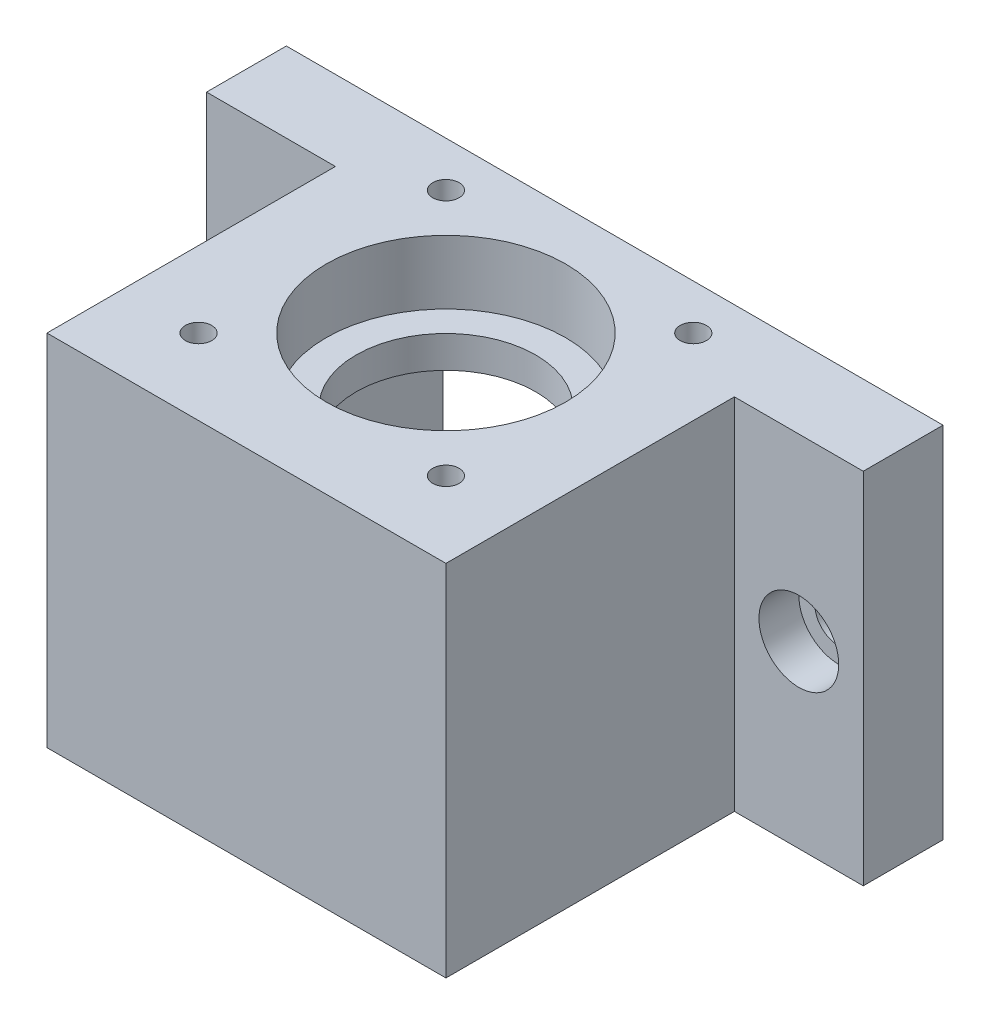
ISO-10303-21;
HEADER;
FILE_DESCRIPTION(('STEP AP214'),'2;1');
FILE_NAME('part.step','',(''),(''),'','','');
FILE_SCHEMA(('AUTOMOTIVE_DESIGN { 1 0 10303 214 1 1 1 1 }'));
ENDSEC;
DATA;
#1=APPLICATION_CONTEXT('core data for automotive mechanical design processes');
#2=APPLICATION_PROTOCOL_DEFINITION('international standard','automotive_design',2000,#1);
#3=PRODUCT_CONTEXT('',#1,'mechanical');
#4=PRODUCT('Part','Part','',(#3));
#5=PRODUCT_RELATED_PRODUCT_CATEGORY('part','',(#4));
#6=PRODUCT_DEFINITION_FORMATION('','',#4);
#7=PRODUCT_DEFINITION_CONTEXT('part definition',#1,'design');
#8=PRODUCT_DEFINITION('design','',#6,#7);
#9=PRODUCT_DEFINITION_SHAPE('','',#8);
#10=(LENGTH_UNIT() NAMED_UNIT(*) SI_UNIT(.MILLI.,.METRE.));
#11=(NAMED_UNIT(*) PLANE_ANGLE_UNIT() SI_UNIT($,.RADIAN.));
#12=(NAMED_UNIT(*) SI_UNIT($,.STERADIAN.) SOLID_ANGLE_UNIT());
#13=UNCERTAINTY_MEASURE_WITH_UNIT(LENGTH_MEASURE(1.E-05),#10,'distance_accuracy_value','');
#14=(GEOMETRIC_REPRESENTATION_CONTEXT(3) GLOBAL_UNCERTAINTY_ASSIGNED_CONTEXT((#13)) GLOBAL_UNIT_ASSIGNED_CONTEXT((#10,
#11,#12)) REPRESENTATION_CONTEXT('',''));
#15=CARTESIAN_POINT('',(0.,0.,0.));
#16=DIRECTION('',(0.,0.,1.));
#17=DIRECTION('',(1.,0.,0.));
#18=AXIS2_PLACEMENT_3D('',#15,#16,#17);
#19=CARTESIAN_POINT('',(0.,45.,0.));
#20=DIRECTION('',(0.,-1.,0.));
#21=DIRECTION('',(0.,0.,-1.));
#22=AXIS2_PLACEMENT_3D('',#19,#20,#21);
#23=CYLINDRICAL_SURFACE('',#22,11.25);
#24=CARTESIAN_POINT('',(0.,33.,0.));
#25=DIRECTION('',(0.,-1.,0.));
#26=DIRECTION('',(0.,0.,-1.));
#27=AXIS2_PLACEMENT_3D('',#24,#25,#26);
#28=CIRCLE('',#27,11.25);
#29=CARTESIAN_POINT('',(0.,33.,-11.25));
#30=VERTEX_POINT('',#29);
#31=EDGE_CURVE('E229',#30,#30,#28,.T.);
#32=ORIENTED_EDGE('',*,*,#31,.T.);
#33=EDGE_LOOP('',(#32));
#34=FACE_BOUND('',#33,.T.);
#35=CARTESIAN_POINT('',(0.,37.,0.));
#36=DIRECTION('',(0.,1.,0.));
#37=DIRECTION('',(0.,0.,1.));
#38=AXIS2_PLACEMENT_3D('',#35,#36,#37);
#39=CIRCLE('',#38,11.25);
#40=CARTESIAN_POINT('',(0.,37.,11.25));
#41=VERTEX_POINT('',#40);
#42=EDGE_CURVE('E39',#41,#41,#39,.F.);
#43=ORIENTED_EDGE('',*,*,#42,.F.);
#44=EDGE_LOOP('',(#43));
#45=FACE_BOUND('',#44,.T.);
#46=ADVANCED_FACE('F35',(#34,#45),#23,.F.);
#47=CARTESIAN_POINT('',(33.075,22.5,-21.15));
#48=DIRECTION('',(0.,0.,1.));
#49=DIRECTION('',(1.,0.,0.));
#50=AXIS2_PLACEMENT_3D('',#47,#48,#49);
#51=CYLINDRICAL_SURFACE('',#50,3.);
#52=CARTESIAN_POINT('',(33.075,22.5,-21.15));
#53=DIRECTION('',(0.,0.,1.));
#54=DIRECTION('',(1.,0.,0.));
#55=AXIS2_PLACEMENT_3D('',#52,#53,#54);
#56=CIRCLE('',#55,3.);
#57=CARTESIAN_POINT('',(36.075,22.5,-21.15));
#58=VERTEX_POINT('',#57);
#59=EDGE_CURVE('E179',#58,#58,#56,.T.);
#60=ORIENTED_EDGE('',*,*,#59,.F.);
#61=EDGE_LOOP('',(#60));
#62=FACE_BOUND('',#61,.T.);
#63=CARTESIAN_POINT('',(33.075,22.5,-16.15));
#64=DIRECTION('',(0.,0.,1.));
#65=DIRECTION('',(1.,0.,0.));
#66=AXIS2_PLACEMENT_3D('',#63,#64,#65);
#67=CIRCLE('',#66,3.);
#68=CARTESIAN_POINT('',(36.075,22.5,-16.15));
#69=VERTEX_POINT('',#68);
#70=EDGE_CURVE('E181',#69,#69,#67,.F.);
#71=ORIENTED_EDGE('',*,*,#70,.F.);
#72=EDGE_LOOP('',(#71));
#73=FACE_BOUND('',#72,.T.);
#74=ADVANCED_FACE('F361',(#62,#73),#51,.F.);
#75=CARTESIAN_POINT('',(-33.075,22.5,-21.15));
#76=DIRECTION('',(0.,0.,1.));
#77=DIRECTION('',(1.,0.,0.));
#78=AXIS2_PLACEMENT_3D('',#75,#76,#77);
#79=CYLINDRICAL_SURFACE('',#78,3.);
#80=CARTESIAN_POINT('',(-33.075,22.5,-21.15));
#81=DIRECTION('',(0.,0.,1.));
#82=DIRECTION('',(1.,0.,0.));
#83=AXIS2_PLACEMENT_3D('',#80,#81,#82);
#84=CIRCLE('',#83,3.);
#85=CARTESIAN_POINT('',(-30.075,22.5,-21.15));
#86=VERTEX_POINT('',#85);
#87=EDGE_CURVE('E204',#86,#86,#84,.T.);
#88=ORIENTED_EDGE('',*,*,#87,.F.);
#89=EDGE_LOOP('',(#88));
#90=FACE_BOUND('',#89,.T.);
#91=CARTESIAN_POINT('',(-33.075,22.5,-16.15));
#92=DIRECTION('',(0.,0.,1.));
#93=DIRECTION('',(1.,0.,0.));
#94=AXIS2_PLACEMENT_3D('',#91,#92,#93);
#95=CIRCLE('',#94,3.);
#96=CARTESIAN_POINT('',(-30.075,22.5,-16.15));
#97=VERTEX_POINT('',#96);
#98=EDGE_CURVE('E177',#97,#97,#95,.F.);
#99=ORIENTED_EDGE('',*,*,#98,.F.);
#100=EDGE_LOOP('',(#99));
#101=FACE_BOUND('',#100,.T.);
#102=ADVANCED_FACE('F367',(#90,#101),#79,.F.);
#103=CARTESIAN_POINT('',(-21.15,45.,-21.15));
#104=DIRECTION('',(0.,0.,1.));
#105=DIRECTION('',(1.,0.,0.));
#106=AXIS2_PLACEMENT_3D('',#103,#104,#105);
#107=PLANE('',#106);
#108=ORIENTED_EDGE('',*,*,#59,.T.);
#109=EDGE_LOOP('',(#108));
#110=FACE_BOUND('',#109,.T.);
#111=ORIENTED_EDGE('',*,*,#87,.T.);
#112=EDGE_LOOP('',(#111));
#113=FACE_BOUND('',#112,.T.);
#114=DIRECTION('',(-1.,0.,0.));
#115=VECTOR('',#114,1.);
#116=CARTESIAN_POINT('',(-21.15,33.,-21.15));
#117=LINE('',#116,#115);
#118=CARTESIAN_POINT('',(21.5,33.,-21.15));
#119=VERTEX_POINT('',#118);
#120=CARTESIAN_POINT('',(-21.5,33.,-21.15));
#121=VERTEX_POINT('',#120);
#122=EDGE_CURVE('E11',#119,#121,#117,.T.);
#123=ORIENTED_EDGE('',*,*,#122,.T.);
#124=DIRECTION('',(0.,-1.,0.));
#125=VECTOR('',#124,1.);
#126=CARTESIAN_POINT('',(-21.5,45.,-21.15));
#127=LINE('',#126,#125);
#128=CARTESIAN_POINT('',(-21.5,0.,-21.15));
#129=VERTEX_POINT('',#128);
#130=EDGE_CURVE('E274',#121,#129,#127,.T.);
#131=ORIENTED_EDGE('',*,*,#130,.T.);
#132=DIRECTION('',(-1.,0.,0.));
#133=VECTOR('',#132,1.);
#134=CARTESIAN_POINT('',(-21.15,0.,-21.15));
#135=LINE('',#134,#133);
#136=CARTESIAN_POINT('',(-41.15,0.,-21.15));
#137=VERTEX_POINT('',#136);
#138=EDGE_CURVE('E147',#129,#137,#135,.T.);
#139=ORIENTED_EDGE('',*,*,#138,.T.);
#140=DIRECTION('',(0.,-1.,0.));
#141=VECTOR('',#140,1.);
#142=CARTESIAN_POINT('',(-41.15,45.,-21.15));
#143=LINE('',#142,#141);
#144=CARTESIAN_POINT('',(-41.15,45.,-21.15));
#145=VERTEX_POINT('',#144);
#146=EDGE_CURVE('E173',#145,#137,#143,.T.);
#147=ORIENTED_EDGE('',*,*,#146,.F.);
#148=DIRECTION('',(-1.,0.,0.));
#149=VECTOR('',#148,1.);
#150=CARTESIAN_POINT('',(21.15,45.,-21.15));
#151=LINE('',#150,#149);
#152=CARTESIAN_POINT('',(41.15,45.,-21.15));
#153=VERTEX_POINT('',#152);
#154=EDGE_CURVE('E100',#153,#145,#151,.T.);
#155=ORIENTED_EDGE('',*,*,#154,.F.);
#156=DIRECTION('',(0.,-1.,0.));
#157=VECTOR('',#156,1.);
#158=CARTESIAN_POINT('',(41.15,45.,-21.15));
#159=LINE('',#158,#157);
#160=CARTESIAN_POINT('',(41.15,0.,-21.15));
#161=VERTEX_POINT('',#160);
#162=EDGE_CURVE('E141',#153,#161,#159,.T.);
#163=ORIENTED_EDGE('',*,*,#162,.T.);
#164=CARTESIAN_POINT('',(21.5,0.,-21.15));
#165=VERTEX_POINT('',#164);
#166=EDGE_CURVE('E94',#161,#165,#135,.T.);
#167=ORIENTED_EDGE('',*,*,#166,.T.);
#168=DIRECTION('',(0.,1.,0.));
#169=VECTOR('',#168,1.);
#170=CARTESIAN_POINT('',(21.5,45.,-21.15));
#171=LINE('',#170,#169);
#172=EDGE_CURVE('E52',#165,#119,#171,.T.);
#173=ORIENTED_EDGE('',*,*,#172,.T.);
#174=EDGE_LOOP('',(#123,#131,#139,#147,#155,#163,#167,#173));
#175=FACE_BOUND('',#174,.T.);
#176=ADVANCED_FACE('F37',(#110,#113,#175),#107,.F.);
#177=CARTESIAN_POINT('',(-41.15,45.,-21.15));
#178=DIRECTION('',(1.,0.,0.));
#179=DIRECTION('',(0.,0.,-1.));
#180=AXIS2_PLACEMENT_3D('',#177,#178,#179);
#181=PLANE('',#180);
#182=DIRECTION('',(0.,0.,1.));
#183=VECTOR('',#182,1.);
#184=CARTESIAN_POINT('',(-41.15,0.,-21.15));
#185=LINE('',#184,#183);
#186=CARTESIAN_POINT('',(-41.15,0.,-11.15));
#187=VERTEX_POINT('',#186);
#188=EDGE_CURVE('E146',#137,#187,#185,.T.);
#189=ORIENTED_EDGE('',*,*,#188,.T.);
#190=DIRECTION('',(0.,-1.,0.));
#191=VECTOR('',#190,1.);
#192=CARTESIAN_POINT('',(-41.15,45.,-11.15));
#193=LINE('',#192,#191);
#194=CARTESIAN_POINT('',(-41.15,45.,-11.15));
#195=VERTEX_POINT('',#194);
#196=EDGE_CURVE('E170',#195,#187,#193,.T.);
#197=ORIENTED_EDGE('',*,*,#196,.F.);
#198=DIRECTION('',(0.,0.,1.));
#199=VECTOR('',#198,1.);
#200=CARTESIAN_POINT('',(-41.15,45.,-21.15));
#201=LINE('',#200,#199);
#202=EDGE_CURVE('E278',#145,#195,#201,.T.);
#203=ORIENTED_EDGE('',*,*,#202,.F.);
#204=ORIENTED_EDGE('',*,*,#146,.T.);
#205=EDGE_LOOP('',(#189,#197,#203,#204));
#206=FACE_BOUND('',#205,.T.);
#207=ADVANCED_FACE('F303',(#206),#181,.F.);
#208=CARTESIAN_POINT('',(-41.15,45.,-11.15));
#209=DIRECTION('',(0.,0.,-1.));
#210=DIRECTION('',(-1.,0.,0.));
#211=AXIS2_PLACEMENT_3D('',#208,#209,#210);
#212=PLANE('',#211);
#213=CARTESIAN_POINT('',(-33.075,22.5,-11.15));
#214=DIRECTION('',(0.,0.,1.));
#215=DIRECTION('',(1.,0.,0.));
#216=AXIS2_PLACEMENT_3D('',#213,#214,#215);
#217=CIRCLE('',#216,5.);
#218=CARTESIAN_POINT('',(-28.075,22.5,-11.15));
#219=VERTEX_POINT('',#218);
#220=EDGE_CURVE('E183',#219,#219,#217,.T.);
#221=ORIENTED_EDGE('',*,*,#220,.F.);
#222=EDGE_LOOP('',(#221));
#223=FACE_BOUND('',#222,.T.);
#224=DIRECTION('',(1.,0.,0.));
#225=VECTOR('',#224,1.);
#226=CARTESIAN_POINT('',(-41.15,0.,-11.15));
#227=LINE('',#226,#225);
#228=CARTESIAN_POINT('',(-25.,0.,-11.15));
#229=VERTEX_POINT('',#228);
#230=EDGE_CURVE('E149',#187,#229,#227,.T.);
#231=ORIENTED_EDGE('',*,*,#230,.T.);
#232=DIRECTION('',(0.,-1.,0.));
#233=VECTOR('',#232,1.);
#234=CARTESIAN_POINT('',(-25.,45.,-11.15));
#235=LINE('',#234,#233);
#236=CARTESIAN_POINT('',(-25.,45.,-11.15));
#237=VERTEX_POINT('',#236);
#238=EDGE_CURVE('E167',#237,#229,#235,.T.);
#239=ORIENTED_EDGE('',*,*,#238,.F.);
#240=DIRECTION('',(1.,0.,0.));
#241=VECTOR('',#240,1.);
#242=CARTESIAN_POINT('',(-41.15,45.,-11.15));
#243=LINE('',#242,#241);
#244=EDGE_CURVE('E280',#195,#237,#243,.T.);
#245=ORIENTED_EDGE('',*,*,#244,.F.);
#246=ORIENTED_EDGE('',*,*,#196,.T.);
#247=EDGE_LOOP('',(#231,#239,#245,#246));
#248=FACE_BOUND('',#247,.T.);
#249=ADVANCED_FACE('F306',(#223,#248),#212,.F.);
#250=CARTESIAN_POINT('',(-25.,45.,-11.15));
#251=DIRECTION('',(1.,0.,0.));
#252=DIRECTION('',(0.,0.,-1.));
#253=AXIS2_PLACEMENT_3D('',#250,#251,#252);
#254=PLANE('',#253);
#255=DIRECTION('',(0.,0.,1.));
#256=VECTOR('',#255,1.);
#257=CARTESIAN_POINT('',(-25.,0.,-11.15));
#258=LINE('',#257,#256);
#259=CARTESIAN_POINT('',(-25.,0.,25.));
#260=VERTEX_POINT('',#259);
#261=EDGE_CURVE('E151',#229,#260,#258,.T.);
#262=ORIENTED_EDGE('',*,*,#261,.T.);
#263=DIRECTION('',(0.,-1.,0.));
#264=VECTOR('',#263,1.);
#265=CARTESIAN_POINT('',(-25.,45.,25.));
#266=LINE('',#265,#264);
#267=CARTESIAN_POINT('',(-25.,45.,25.));
#268=VERTEX_POINT('',#267);
#269=EDGE_CURVE('E164',#268,#260,#266,.T.);
#270=ORIENTED_EDGE('',*,*,#269,.F.);
#271=DIRECTION('',(0.,0.,1.));
#272=VECTOR('',#271,1.);
#273=CARTESIAN_POINT('',(-25.,45.,-11.15));
#274=LINE('',#273,#272);
#275=EDGE_CURVE('E282',#237,#268,#274,.T.);
#276=ORIENTED_EDGE('',*,*,#275,.F.);
#277=ORIENTED_EDGE('',*,*,#238,.T.);
#278=EDGE_LOOP('',(#262,#270,#276,#277));
#279=FACE_BOUND('',#278,.T.);
#280=ADVANCED_FACE('F288',(#279),#254,.F.);
#281=CARTESIAN_POINT('',(-25.,45.,25.));
#282=DIRECTION('',(0.,0.,-1.));
#283=DIRECTION('',(-1.,0.,0.));
#284=AXIS2_PLACEMENT_3D('',#281,#282,#283);
#285=PLANE('',#284);
#286=DIRECTION('',(1.,0.,0.));
#287=VECTOR('',#286,1.);
#288=CARTESIAN_POINT('',(-25.,0.,25.));
#289=LINE('',#288,#287);
#290=CARTESIAN_POINT('',(25.,0.,25.));
#291=VERTEX_POINT('',#290);
#292=EDGE_CURVE('E153',#260,#291,#289,.T.);
#293=ORIENTED_EDGE('',*,*,#292,.T.);
#294=DIRECTION('',(0.,-1.,0.));
#295=VECTOR('',#294,1.);
#296=CARTESIAN_POINT('',(25.,45.,25.));
#297=LINE('',#296,#295);
#298=CARTESIAN_POINT('',(25.,45.,25.));
#299=VERTEX_POINT('',#298);
#300=EDGE_CURVE('E135',#299,#291,#297,.T.);
#301=ORIENTED_EDGE('',*,*,#300,.F.);
#302=DIRECTION('',(1.,0.,0.));
#303=VECTOR('',#302,1.);
#304=CARTESIAN_POINT('',(-25.,45.,25.));
#305=LINE('',#304,#303);
#306=EDGE_CURVE('E123',#268,#299,#305,.T.);
#307=ORIENTED_EDGE('',*,*,#306,.F.);
#308=ORIENTED_EDGE('',*,*,#269,.T.);
#309=EDGE_LOOP('',(#293,#301,#307,#308));
#310=FACE_BOUND('',#309,.T.);
#311=ADVANCED_FACE('F292',(#310),#285,.F.);
#312=CARTESIAN_POINT('',(25.,45.,-11.15));
#313=DIRECTION('',(-1.,0.,0.));
#314=DIRECTION('',(0.,0.,1.));
#315=AXIS2_PLACEMENT_3D('',#312,#313,#314);
#316=PLANE('',#315);
#317=DIRECTION('',(0.,0.,-1.));
#318=VECTOR('',#317,1.);
#319=CARTESIAN_POINT('',(25.,0.,-11.15));
#320=LINE('',#319,#318);
#321=CARTESIAN_POINT('',(25.,0.,-11.15));
#322=VERTEX_POINT('',#321);
#323=EDGE_CURVE('E132',#291,#322,#320,.T.);
#324=ORIENTED_EDGE('',*,*,#323,.T.);
#325=DIRECTION('',(0.,-1.,0.));
#326=VECTOR('',#325,1.);
#327=CARTESIAN_POINT('',(25.,45.,-11.15));
#328=LINE('',#327,#326);
#329=CARTESIAN_POINT('',(25.,45.,-11.15));
#330=VERTEX_POINT('',#329);
#331=EDGE_CURVE('E129',#330,#322,#328,.T.);
#332=ORIENTED_EDGE('',*,*,#331,.F.);
#333=DIRECTION('',(0.,0.,-1.));
#334=VECTOR('',#333,1.);
#335=CARTESIAN_POINT('',(25.,45.,-11.15));
#336=LINE('',#335,#334);
#337=EDGE_CURVE('E116',#299,#330,#336,.T.);
#338=ORIENTED_EDGE('',*,*,#337,.F.);
#339=ORIENTED_EDGE('',*,*,#300,.T.);
#340=EDGE_LOOP('',(#324,#332,#338,#339));
#341=FACE_BOUND('',#340,.T.);
#342=ADVANCED_FACE('F130',(#341),#316,.F.);
#343=CARTESIAN_POINT('',(41.15,45.,-11.15));
#344=DIRECTION('',(0.,0.,-1.));
#345=DIRECTION('',(-1.,0.,0.));
#346=AXIS2_PLACEMENT_3D('',#343,#344,#345);
#347=PLANE('',#346);
#348=CARTESIAN_POINT('',(33.075,22.5,-11.15));
#349=DIRECTION('',(0.,0.,1.));
#350=DIRECTION('',(1.,0.,0.));
#351=AXIS2_PLACEMENT_3D('',#348,#349,#350);
#352=CIRCLE('',#351,5.);
#353=CARTESIAN_POINT('',(38.075,22.5,-11.15));
#354=VERTEX_POINT('',#353);
#355=EDGE_CURVE('E190',#354,#354,#352,.T.);
#356=ORIENTED_EDGE('',*,*,#355,.F.);
#357=EDGE_LOOP('',(#356));
#358=FACE_BOUND('',#357,.T.);
#359=DIRECTION('',(1.,0.,0.));
#360=VECTOR('',#359,1.);
#361=CARTESIAN_POINT('',(41.15,0.,-11.15));
#362=LINE('',#361,#360);
#363=CARTESIAN_POINT('',(41.15,0.,-11.15));
#364=VERTEX_POINT('',#363);
#365=EDGE_CURVE('E156',#322,#364,#362,.T.);
#366=ORIENTED_EDGE('',*,*,#365,.T.);
#367=DIRECTION('',(0.,-1.,0.));
#368=VECTOR('',#367,1.);
#369=CARTESIAN_POINT('',(41.15,45.,-11.15));
#370=LINE('',#369,#368);
#371=CARTESIAN_POINT('',(41.15,45.,-11.15));
#372=VERTEX_POINT('',#371);
#373=EDGE_CURVE('E136',#372,#364,#370,.T.);
#374=ORIENTED_EDGE('',*,*,#373,.F.);
#375=DIRECTION('',(1.,0.,0.));
#376=VECTOR('',#375,1.);
#377=CARTESIAN_POINT('',(41.15,45.,-11.15));
#378=LINE('',#377,#376);
#379=EDGE_CURVE('E120',#330,#372,#378,.T.);
#380=ORIENTED_EDGE('',*,*,#379,.F.);
#381=ORIENTED_EDGE('',*,*,#331,.T.);
#382=EDGE_LOOP('',(#366,#374,#380,#381));
#383=FACE_BOUND('',#382,.T.);
#384=ADVANCED_FACE('F138',(#358,#383),#347,.F.);
#385=CARTESIAN_POINT('',(41.15,45.,-21.15));
#386=DIRECTION('',(-1.,0.,0.));
#387=DIRECTION('',(0.,0.,1.));
#388=AXIS2_PLACEMENT_3D('',#385,#386,#387);
#389=PLANE('',#388);
#390=DIRECTION('',(0.,0.,-1.));
#391=VECTOR('',#390,1.);
#392=CARTESIAN_POINT('',(41.15,0.,-21.15));
#393=LINE('',#392,#391);
#394=EDGE_CURVE('E158',#364,#161,#393,.T.);
#395=ORIENTED_EDGE('',*,*,#394,.T.);
#396=ORIENTED_EDGE('',*,*,#162,.F.);
#397=DIRECTION('',(0.,0.,-1.));
#398=VECTOR('',#397,1.);
#399=CARTESIAN_POINT('',(41.15,45.,-21.15));
#400=LINE('',#399,#398);
#401=EDGE_CURVE('E61',#372,#153,#400,.T.);
#402=ORIENTED_EDGE('',*,*,#401,.F.);
#403=ORIENTED_EDGE('',*,*,#373,.T.);
#404=EDGE_LOOP('',(#395,#396,#402,#403));
#405=FACE_BOUND('',#404,.T.);
#406=ADVANCED_FACE('F296',(#405),#389,.F.);
#407=CARTESIAN_POINT('',(0.,45.,0.));
#408=DIRECTION('',(0.,-1.,0.));
#409=DIRECTION('',(0.,0.,-1.));
#410=AXIS2_PLACEMENT_3D('',#407,#408,#409);
#411=PLANE('',#410);
#412=CARTESIAN_POINT('',(0.,45.,0.));
#413=DIRECTION('',(0.,1.,0.));
#414=DIRECTION('',(0.,0.,1.));
#415=AXIS2_PLACEMENT_3D('',#412,#413,#414);
#416=CIRCLE('',#415,15.);
#417=CARTESIAN_POINT('',(0.,45.,15.));
#418=VERTEX_POINT('',#417);
#419=EDGE_CURVE('E197',#418,#418,#416,.T.);
#420=ORIENTED_EDGE('',*,*,#419,.F.);
#421=EDGE_LOOP('',(#420));
#422=FACE_BOUND('',#421,.T.);
#423=CARTESIAN_POINT('',(15.5,45.,-15.5));
#424=DIRECTION('',(0.,-1.,0.));
#425=DIRECTION('',(0.,0.,-1.));
#426=AXIS2_PLACEMENT_3D('',#423,#424,#425);
#427=CIRCLE('',#426,1.65);
#428=CARTESIAN_POINT('',(15.5,45.,-17.15));
#429=VERTEX_POINT('',#428);
#430=EDGE_CURVE('E208',#429,#429,#427,.T.);
#431=ORIENTED_EDGE('',*,*,#430,.T.);
#432=EDGE_LOOP('',(#431));
#433=FACE_BOUND('',#432,.T.);
#434=CARTESIAN_POINT('',(-15.5,45.,-15.5));
#435=DIRECTION('',(0.,-1.,0.));
#436=DIRECTION('',(0.,0.,-1.));
#437=AXIS2_PLACEMENT_3D('',#434,#435,#436);
#438=CIRCLE('',#437,1.65);
#439=CARTESIAN_POINT('',(-15.5,45.,-17.15));
#440=VERTEX_POINT('',#439);
#441=EDGE_CURVE('E214',#440,#440,#438,.T.);
#442=ORIENTED_EDGE('',*,*,#441,.T.);
#443=EDGE_LOOP('',(#442));
#444=FACE_BOUND('',#443,.T.);
#445=CARTESIAN_POINT('',(15.5,45.,15.5));
#446=DIRECTION('',(0.,-1.,0.));
#447=DIRECTION('',(0.,0.,-1.));
#448=AXIS2_PLACEMENT_3D('',#445,#446,#447);
#449=CIRCLE('',#448,1.65);
#450=CARTESIAN_POINT('',(15.5,45.,13.85));
#451=VERTEX_POINT('',#450);
#452=EDGE_CURVE('E220',#451,#451,#449,.T.);
#453=ORIENTED_EDGE('',*,*,#452,.T.);
#454=EDGE_LOOP('',(#453));
#455=FACE_BOUND('',#454,.T.);
#456=CARTESIAN_POINT('',(-15.5,45.,15.5));
#457=DIRECTION('',(0.,-1.,0.));
#458=DIRECTION('',(0.,0.,-1.));
#459=AXIS2_PLACEMENT_3D('',#456,#457,#458);
#460=CIRCLE('',#459,1.65);
#461=CARTESIAN_POINT('',(-15.5,45.,13.85));
#462=VERTEX_POINT('',#461);
#463=EDGE_CURVE('E226',#462,#462,#460,.T.);
#464=ORIENTED_EDGE('',*,*,#463,.T.);
#465=EDGE_LOOP('',(#464));
#466=FACE_BOUND('',#465,.T.);
#467=ORIENTED_EDGE('',*,*,#154,.T.);
#468=ORIENTED_EDGE('',*,*,#202,.T.);
#469=ORIENTED_EDGE('',*,*,#244,.T.);
#470=ORIENTED_EDGE('',*,*,#275,.T.);
#471=ORIENTED_EDGE('',*,*,#306,.T.);
#472=ORIENTED_EDGE('',*,*,#337,.T.);
#473=ORIENTED_EDGE('',*,*,#379,.T.);
#474=ORIENTED_EDGE('',*,*,#401,.T.);
#475=EDGE_LOOP('',(#467,#468,#469,#470,#471,#472,#473,#474));
#476=FACE_BOUND('',#475,.T.);
#477=ADVANCED_FACE('F118',(#422,#433,#444,#455,#466,#476),#411,.F.);
#478=CARTESIAN_POINT('',(0.,0.,0.));
#479=DIRECTION('',(0.,-1.,0.));
#480=DIRECTION('',(0.,0.,-1.));
#481=AXIS2_PLACEMENT_3D('',#478,#479,#480);
#482=PLANE('',#481);
#483=DIRECTION('',(0.,0.,-1.));
#484=VECTOR('',#483,1.);
#485=CARTESIAN_POINT('',(-21.5,0.,-21.5));
#486=LINE('',#485,#484);
#487=CARTESIAN_POINT('',(-21.5,0.,16.5));
#488=VERTEX_POINT('',#487);
#489=EDGE_CURVE('E234',#488,#129,#486,.T.);
#490=ORIENTED_EDGE('',*,*,#489,.F.);
#491=DIRECTION('',(-0.707106781186548,0.,-0.707106781186548));
#492=VECTOR('',#491,1.);
#493=CARTESIAN_POINT('',(-21.5,0.,16.5));
#494=LINE('',#493,#492);
#495=CARTESIAN_POINT('',(-16.5,0.,21.5));
#496=VERTEX_POINT('',#495);
#497=EDGE_CURVE('E239',#496,#488,#494,.T.);
#498=ORIENTED_EDGE('',*,*,#497,.F.);
#499=DIRECTION('',(-1.,0.,0.));
#500=VECTOR('',#499,1.);
#501=CARTESIAN_POINT('',(-16.5,0.,21.5));
#502=LINE('',#501,#500);
#503=CARTESIAN_POINT('',(16.5,0.,21.5));
#504=VERTEX_POINT('',#503);
#505=EDGE_CURVE('E257',#504,#496,#502,.T.);
#506=ORIENTED_EDGE('',*,*,#505,.F.);
#507=DIRECTION('',(-0.707106781186548,0.,0.707106781186548));
#508=VECTOR('',#507,1.);
#509=CARTESIAN_POINT('',(16.5,0.,21.5));
#510=LINE('',#509,#508);
#511=CARTESIAN_POINT('',(21.5,0.,16.5));
#512=VERTEX_POINT('',#511);
#513=EDGE_CURVE('E254',#512,#504,#510,.T.);
#514=ORIENTED_EDGE('',*,*,#513,.F.);
#515=DIRECTION('',(0.,0.,1.));
#516=VECTOR('',#515,1.);
#517=CARTESIAN_POINT('',(21.5,0.,0.));
#518=LINE('',#517,#516);
#519=EDGE_CURVE('E44',#165,#512,#518,.T.);
#520=ORIENTED_EDGE('',*,*,#519,.F.);
#521=ORIENTED_EDGE('',*,*,#166,.F.);
#522=ORIENTED_EDGE('',*,*,#394,.F.);
#523=ORIENTED_EDGE('',*,*,#365,.F.);
#524=ORIENTED_EDGE('',*,*,#323,.F.);
#525=ORIENTED_EDGE('',*,*,#292,.F.);
#526=ORIENTED_EDGE('',*,*,#261,.F.);
#527=ORIENTED_EDGE('',*,*,#230,.F.);
#528=ORIENTED_EDGE('',*,*,#188,.F.);
#529=ORIENTED_EDGE('',*,*,#138,.F.);
#530=EDGE_LOOP('',(#490,#498,#506,#514,#520,#521,#522,#523,#524,#525,#526,#527,#528,#529));
#531=FACE_BOUND('',#530,.T.);
#532=ADVANCED_FACE('F294',(#531),#482,.T.);
#533=CARTESIAN_POINT('',(0.,33.,0.));
#534=DIRECTION('',(0.,1.,0.));
#535=DIRECTION('',(0.,0.,1.));
#536=AXIS2_PLACEMENT_3D('',#533,#534,#535);
#537=PLANE('',#536);
#538=CARTESIAN_POINT('',(15.5,33.,-15.5));
#539=DIRECTION('',(0.,-1.,0.));
#540=DIRECTION('',(0.,0.,-1.));
#541=AXIS2_PLACEMENT_3D('',#538,#539,#540);
#542=CIRCLE('',#541,1.65);
#543=CARTESIAN_POINT('',(15.5,33.,-17.15));
#544=VERTEX_POINT('',#543);
#545=EDGE_CURVE('E207',#544,#544,#542,.T.);
#546=ORIENTED_EDGE('',*,*,#545,.F.);
#547=EDGE_LOOP('',(#546));
#548=FACE_BOUND('',#547,.T.);
#549=CARTESIAN_POINT('',(-15.5,33.,-15.5));
#550=DIRECTION('',(0.,-1.,0.));
#551=DIRECTION('',(0.,0.,-1.));
#552=AXIS2_PLACEMENT_3D('',#549,#550,#551);
#553=CIRCLE('',#552,1.65);
#554=CARTESIAN_POINT('',(-15.5,33.,-17.15));
#555=VERTEX_POINT('',#554);
#556=EDGE_CURVE('E211',#555,#555,#553,.T.);
#557=ORIENTED_EDGE('',*,*,#556,.F.);
#558=EDGE_LOOP('',(#557));
#559=FACE_BOUND('',#558,.T.);
#560=CARTESIAN_POINT('',(15.5,33.,15.5));
#561=DIRECTION('',(0.,-1.,0.));
#562=DIRECTION('',(0.,0.,-1.));
#563=AXIS2_PLACEMENT_3D('',#560,#561,#562);
#564=CIRCLE('',#563,1.65);
#565=CARTESIAN_POINT('',(15.5,33.,13.85));
#566=VERTEX_POINT('',#565);
#567=EDGE_CURVE('E217',#566,#566,#564,.T.);
#568=ORIENTED_EDGE('',*,*,#567,.F.);
#569=EDGE_LOOP('',(#568));
#570=FACE_BOUND('',#569,.T.);
#571=CARTESIAN_POINT('',(-15.5,33.,15.5));
#572=DIRECTION('',(0.,-1.,0.));
#573=DIRECTION('',(0.,0.,-1.));
#574=AXIS2_PLACEMENT_3D('',#571,#572,#573);
#575=CIRCLE('',#574,1.65);
#576=CARTESIAN_POINT('',(-15.5,33.,13.85));
#577=VERTEX_POINT('',#576);
#578=EDGE_CURVE('E223',#577,#577,#575,.T.);
#579=ORIENTED_EDGE('',*,*,#578,.F.);
#580=EDGE_LOOP('',(#579));
#581=FACE_BOUND('',#580,.T.);
#582=ORIENTED_EDGE('',*,*,#31,.F.);
#583=EDGE_LOOP('',(#582));
#584=FACE_BOUND('',#583,.T.);
#585=DIRECTION('',(0.,0.,1.));
#586=VECTOR('',#585,1.);
#587=CARTESIAN_POINT('',(21.5,33.,-21.5));
#588=LINE('',#587,#586);
#589=CARTESIAN_POINT('',(21.5,33.,16.5));
#590=VERTEX_POINT('',#589);
#591=EDGE_CURVE('E238',#119,#590,#588,.T.);
#592=ORIENTED_EDGE('',*,*,#591,.T.);
#593=DIRECTION('',(-0.707106781186548,0.,0.707106781186548));
#594=VECTOR('',#593,1.);
#595=CARTESIAN_POINT('',(16.5,33.,21.5));
#596=LINE('',#595,#594);
#597=CARTESIAN_POINT('',(16.5,33.,21.5));
#598=VERTEX_POINT('',#597);
#599=EDGE_CURVE('E242',#590,#598,#596,.T.);
#600=ORIENTED_EDGE('',*,*,#599,.T.);
#601=DIRECTION('',(-1.,0.,0.));
#602=VECTOR('',#601,1.);
#603=CARTESIAN_POINT('',(-16.5,33.,21.5));
#604=LINE('',#603,#602);
#605=CARTESIAN_POINT('',(-16.5,33.,21.5));
#606=VERTEX_POINT('',#605);
#607=EDGE_CURVE('E245',#598,#606,#604,.T.);
#608=ORIENTED_EDGE('',*,*,#607,.T.);
#609=DIRECTION('',(-0.707106781186548,0.,-0.707106781186548));
#610=VECTOR('',#609,1.);
#611=CARTESIAN_POINT('',(-21.5,33.,16.5));
#612=LINE('',#611,#610);
#613=CARTESIAN_POINT('',(-21.5,33.,16.5));
#614=VERTEX_POINT('',#613);
#615=EDGE_CURVE('E248',#606,#614,#612,.T.);
#616=ORIENTED_EDGE('',*,*,#615,.T.);
#617=DIRECTION('',(0.,0.,-1.));
#618=VECTOR('',#617,1.);
#619=CARTESIAN_POINT('',(-21.5,33.,-21.5));
#620=LINE('',#619,#618);
#621=EDGE_CURVE('E235',#614,#121,#620,.T.);
#622=ORIENTED_EDGE('',*,*,#621,.T.);
#623=ORIENTED_EDGE('',*,*,#122,.F.);
#624=EDGE_LOOP('',(#592,#600,#608,#616,#622,#623));
#625=FACE_BOUND('',#624,.T.);
#626=ADVANCED_FACE('F335',(#548,#559,#570,#581,#584,#625),#537,.F.);
#627=CARTESIAN_POINT('',(-21.5,33.,-21.5));
#628=DIRECTION('',(-1.,0.,0.));
#629=DIRECTION('',(0.,0.,1.));
#630=AXIS2_PLACEMENT_3D('',#627,#628,#629);
#631=PLANE('',#630);
#632=ORIENTED_EDGE('',*,*,#621,.F.);
#633=DIRECTION('',(0.,-1.,0.));
#634=VECTOR('',#633,1.);
#635=CARTESIAN_POINT('',(-21.5,33.,16.5));
#636=LINE('',#635,#634);
#637=EDGE_CURVE('E262',#614,#488,#636,.T.);
#638=ORIENTED_EDGE('',*,*,#637,.T.);
#639=ORIENTED_EDGE('',*,*,#489,.T.);
#640=ORIENTED_EDGE('',*,*,#130,.F.);
#641=EDGE_LOOP('',(#632,#638,#639,#640));
#642=FACE_BOUND('',#641,.T.);
#643=ADVANCED_FACE('F349',(#642),#631,.F.);
#644=CARTESIAN_POINT('',(21.5,33.,-21.5));
#645=DIRECTION('',(1.,0.,0.));
#646=DIRECTION('',(0.,0.,-1.));
#647=AXIS2_PLACEMENT_3D('',#644,#645,#646);
#648=PLANE('',#647);
#649=ORIENTED_EDGE('',*,*,#519,.T.);
#650=DIRECTION('',(0.,-1.,0.));
#651=VECTOR('',#650,1.);
#652=CARTESIAN_POINT('',(21.5,33.,16.5));
#653=LINE('',#652,#651);
#654=EDGE_CURVE('E251',#590,#512,#653,.T.);
#655=ORIENTED_EDGE('',*,*,#654,.F.);
#656=ORIENTED_EDGE('',*,*,#591,.F.);
#657=ORIENTED_EDGE('',*,*,#172,.F.);
#658=EDGE_LOOP('',(#649,#655,#656,#657));
#659=FACE_BOUND('',#658,.T.);
#660=ADVANCED_FACE('F337',(#659),#648,.F.);
#661=CARTESIAN_POINT('',(-21.5,33.,16.5));
#662=DIRECTION('',(-0.707106781186547,0.,0.707106781186547));
#663=DIRECTION('',(0.707106781186548,0.,0.707106781186548));
#664=AXIS2_PLACEMENT_3D('',#661,#662,#663);
#665=PLANE('',#664);
#666=ORIENTED_EDGE('',*,*,#497,.T.);
#667=ORIENTED_EDGE('',*,*,#637,.F.);
#668=ORIENTED_EDGE('',*,*,#615,.F.);
#669=DIRECTION('',(0.,-1.,0.));
#670=VECTOR('',#669,1.);
#671=CARTESIAN_POINT('',(-16.5,33.,21.5));
#672=LINE('',#671,#670);
#673=EDGE_CURVE('E265',#606,#496,#672,.T.);
#674=ORIENTED_EDGE('',*,*,#673,.T.);
#675=EDGE_LOOP('',(#666,#667,#668,#674));
#676=FACE_BOUND('',#675,.T.);
#677=ADVANCED_FACE('F347',(#676),#665,.F.);
#678=CARTESIAN_POINT('',(-16.5,33.,21.5));
#679=DIRECTION('',(0.,0.,1.));
#680=DIRECTION('',(1.,0.,0.));
#681=AXIS2_PLACEMENT_3D('',#678,#679,#680);
#682=PLANE('',#681);
#683=ORIENTED_EDGE('',*,*,#505,.T.);
#684=ORIENTED_EDGE('',*,*,#673,.F.);
#685=ORIENTED_EDGE('',*,*,#607,.F.);
#686=DIRECTION('',(0.,-1.,0.));
#687=VECTOR('',#686,1.);
#688=CARTESIAN_POINT('',(16.5,33.,21.5));
#689=LINE('',#688,#687);
#690=EDGE_CURVE('E268',#598,#504,#689,.T.);
#691=ORIENTED_EDGE('',*,*,#690,.T.);
#692=EDGE_LOOP('',(#683,#684,#685,#691));
#693=FACE_BOUND('',#692,.T.);
#694=ADVANCED_FACE('F344',(#693),#682,.F.);
#695=CARTESIAN_POINT('',(16.5,33.,21.5));
#696=DIRECTION('',(0.707106781186547,0.,0.707106781186547));
#697=DIRECTION('',(0.707106781186548,0.,-0.707106781186548));
#698=AXIS2_PLACEMENT_3D('',#695,#696,#697);
#699=PLANE('',#698);
#700=ORIENTED_EDGE('',*,*,#513,.T.);
#701=ORIENTED_EDGE('',*,*,#690,.F.);
#702=ORIENTED_EDGE('',*,*,#599,.F.);
#703=ORIENTED_EDGE('',*,*,#654,.T.);
#704=EDGE_LOOP('',(#700,#701,#702,#703));
#705=FACE_BOUND('',#704,.T.);
#706=ADVANCED_FACE('F340',(#705),#699,.F.);
#707=CARTESIAN_POINT('',(-15.5,45.,15.5));
#708=DIRECTION('',(0.,-1.,0.));
#709=DIRECTION('',(0.,0.,-1.));
#710=AXIS2_PLACEMENT_3D('',#707,#708,#709);
#711=CYLINDRICAL_SURFACE('',#710,1.65);
#712=ORIENTED_EDGE('',*,*,#463,.F.);
#713=EDGE_LOOP('',(#712));
#714=FACE_BOUND('',#713,.T.);
#715=ORIENTED_EDGE('',*,*,#578,.T.);
#716=EDGE_LOOP('',(#715));
#717=FACE_BOUND('',#716,.T.);
#718=ADVANCED_FACE('F372',(#714,#717),#711,.F.);
#719=CARTESIAN_POINT('',(15.5,45.,15.5));
#720=DIRECTION('',(0.,-1.,0.));
#721=DIRECTION('',(0.,0.,-1.));
#722=AXIS2_PLACEMENT_3D('',#719,#720,#721);
#723=CYLINDRICAL_SURFACE('',#722,1.65);
#724=ORIENTED_EDGE('',*,*,#452,.F.);
#725=EDGE_LOOP('',(#724));
#726=FACE_BOUND('',#725,.T.);
#727=ORIENTED_EDGE('',*,*,#567,.T.);
#728=EDGE_LOOP('',(#727));
#729=FACE_BOUND('',#728,.T.);
#730=ADVANCED_FACE('F383',(#726,#729),#723,.F.);
#731=CARTESIAN_POINT('',(-15.5,45.,-15.5));
#732=DIRECTION('',(0.,-1.,0.));
#733=DIRECTION('',(0.,0.,-1.));
#734=AXIS2_PLACEMENT_3D('',#731,#732,#733);
#735=CYLINDRICAL_SURFACE('',#734,1.65);
#736=ORIENTED_EDGE('',*,*,#441,.F.);
#737=EDGE_LOOP('',(#736));
#738=FACE_BOUND('',#737,.T.);
#739=ORIENTED_EDGE('',*,*,#556,.T.);
#740=EDGE_LOOP('',(#739));
#741=FACE_BOUND('',#740,.T.);
#742=ADVANCED_FACE('F388',(#738,#741),#735,.F.);
#743=CARTESIAN_POINT('',(15.5,45.,-15.5));
#744=DIRECTION('',(0.,-1.,0.));
#745=DIRECTION('',(0.,0.,-1.));
#746=AXIS2_PLACEMENT_3D('',#743,#744,#745);
#747=CYLINDRICAL_SURFACE('',#746,1.65);
#748=ORIENTED_EDGE('',*,*,#430,.F.);
#749=EDGE_LOOP('',(#748));
#750=FACE_BOUND('',#749,.T.);
#751=ORIENTED_EDGE('',*,*,#545,.T.);
#752=EDGE_LOOP('',(#751));
#753=FACE_BOUND('',#752,.T.);
#754=ADVANCED_FACE('F438',(#750,#753),#747,.F.);
#755=CARTESIAN_POINT('',(-33.075,22.5,-16.15));
#756=DIRECTION('',(0.,0.,1.));
#757=DIRECTION('',(1.,0.,0.));
#758=AXIS2_PLACEMENT_3D('',#755,#756,#757);
#759=PLANE('',#758);
#760=CARTESIAN_POINT('',(-33.075,22.5,-16.15));
#761=DIRECTION('',(0.,0.,1.));
#762=DIRECTION('',(1.,0.,0.));
#763=AXIS2_PLACEMENT_3D('',#760,#761,#762);
#764=CIRCLE('',#763,5.);
#765=CARTESIAN_POINT('',(-28.075,22.5,-16.15));
#766=VERTEX_POINT('',#765);
#767=EDGE_CURVE('E180',#766,#766,#764,.T.);
#768=ORIENTED_EDGE('',*,*,#767,.T.);
#769=EDGE_LOOP('',(#768));
#770=FACE_BOUND('',#769,.T.);
#771=ORIENTED_EDGE('',*,*,#98,.T.);
#772=EDGE_LOOP('',(#771));
#773=FACE_BOUND('',#772,.T.);
#774=ADVANCED_FACE('F435',(#770,#773),#759,.T.);
#775=CARTESIAN_POINT('',(-33.075,22.5,-16.15));
#776=DIRECTION('',(0.,0.,1.));
#777=DIRECTION('',(1.,0.,0.));
#778=AXIS2_PLACEMENT_3D('',#775,#776,#777);
#779=CYLINDRICAL_SURFACE('',#778,5.);
#780=ORIENTED_EDGE('',*,*,#767,.F.);
#781=EDGE_LOOP('',(#780));
#782=FACE_BOUND('',#781,.T.);
#783=ORIENTED_EDGE('',*,*,#220,.T.);
#784=EDGE_LOOP('',(#783));
#785=FACE_BOUND('',#784,.T.);
#786=ADVANCED_FACE('F437',(#782,#785),#779,.F.);
#787=CARTESIAN_POINT('',(33.075,22.5,-16.15));
#788=DIRECTION('',(0.,0.,1.));
#789=DIRECTION('',(1.,0.,0.));
#790=AXIS2_PLACEMENT_3D('',#787,#788,#789);
#791=PLANE('',#790);
#792=CARTESIAN_POINT('',(33.075,22.5,-16.15));
#793=DIRECTION('',(0.,0.,1.));
#794=DIRECTION('',(1.,0.,0.));
#795=AXIS2_PLACEMENT_3D('',#792,#793,#794);
#796=CIRCLE('',#795,5.);
#797=CARTESIAN_POINT('',(38.075,22.5,-16.15));
#798=VERTEX_POINT('',#797);
#799=EDGE_CURVE('E184',#798,#798,#796,.T.);
#800=ORIENTED_EDGE('',*,*,#799,.T.);
#801=EDGE_LOOP('',(#800));
#802=FACE_BOUND('',#801,.T.);
#803=ORIENTED_EDGE('',*,*,#70,.T.);
#804=EDGE_LOOP('',(#803));
#805=FACE_BOUND('',#804,.T.);
#806=ADVANCED_FACE('F445',(#802,#805),#791,.T.);
#807=CARTESIAN_POINT('',(33.075,22.5,-16.15));
#808=DIRECTION('',(0.,0.,1.));
#809=DIRECTION('',(1.,0.,0.));
#810=AXIS2_PLACEMENT_3D('',#807,#808,#809);
#811=CYLINDRICAL_SURFACE('',#810,5.);
#812=ORIENTED_EDGE('',*,*,#799,.F.);
#813=EDGE_LOOP('',(#812));
#814=FACE_BOUND('',#813,.T.);
#815=ORIENTED_EDGE('',*,*,#355,.T.);
#816=EDGE_LOOP('',(#815));
#817=FACE_BOUND('',#816,.T.);
#818=ADVANCED_FACE('F451',(#814,#817),#811,.F.);
#819=CARTESIAN_POINT('',(0.,37.,0.));
#820=DIRECTION('',(0.,1.,0.));
#821=DIRECTION('',(0.,0.,1.));
#822=AXIS2_PLACEMENT_3D('',#819,#820,#821);
#823=PLANE('',#822);
#824=CARTESIAN_POINT('',(0.,37.,0.));
#825=DIRECTION('',(0.,1.,0.));
#826=DIRECTION('',(0.,0.,1.));
#827=AXIS2_PLACEMENT_3D('',#824,#825,#826);
#828=CIRCLE('',#827,15.);
#829=CARTESIAN_POINT('',(0.,37.,15.));
#830=VERTEX_POINT('',#829);
#831=EDGE_CURVE('E568',#830,#830,#828,.T.);
#832=ORIENTED_EDGE('',*,*,#831,.T.);
#833=EDGE_LOOP('',(#832));
#834=FACE_BOUND('',#833,.T.);
#835=ORIENTED_EDGE('',*,*,#42,.T.);
#836=EDGE_LOOP('',(#835));
#837=FACE_BOUND('',#836,.T.);
#838=ADVANCED_FACE('F532',(#834,#837),#823,.T.);
#839=CARTESIAN_POINT('',(0.,37.,0.));
#840=DIRECTION('',(0.,1.,0.));
#841=DIRECTION('',(0.,0.,1.));
#842=AXIS2_PLACEMENT_3D('',#839,#840,#841);
#843=CYLINDRICAL_SURFACE('',#842,15.);
#844=ORIENTED_EDGE('',*,*,#831,.F.);
#845=EDGE_LOOP('',(#844));
#846=FACE_BOUND('',#845,.T.);
#847=ORIENTED_EDGE('',*,*,#419,.T.);
#848=EDGE_LOOP('',(#847));
#849=FACE_BOUND('',#848,.T.);
#850=ADVANCED_FACE('F551',(#846,#849),#843,.F.);
#851=CLOSED_SHELL('',(#46,#74,#102,#176,#207,#249,#280,#311,#342,#384,#406,#477,#532,#626,#643,
#660,#677,#694,#706,#718,#730,#742,#754,#774,#786,#806,#818,#838,#850));
#852=MANIFOLD_SOLID_BREP('B2',#851);
#853=ADVANCED_BREP_SHAPE_REPRESENTATION('',(#18,#852),#14);
#854=SHAPE_DEFINITION_REPRESENTATION(#9,#853);
ENDSEC;
END-ISO-10303-21;
